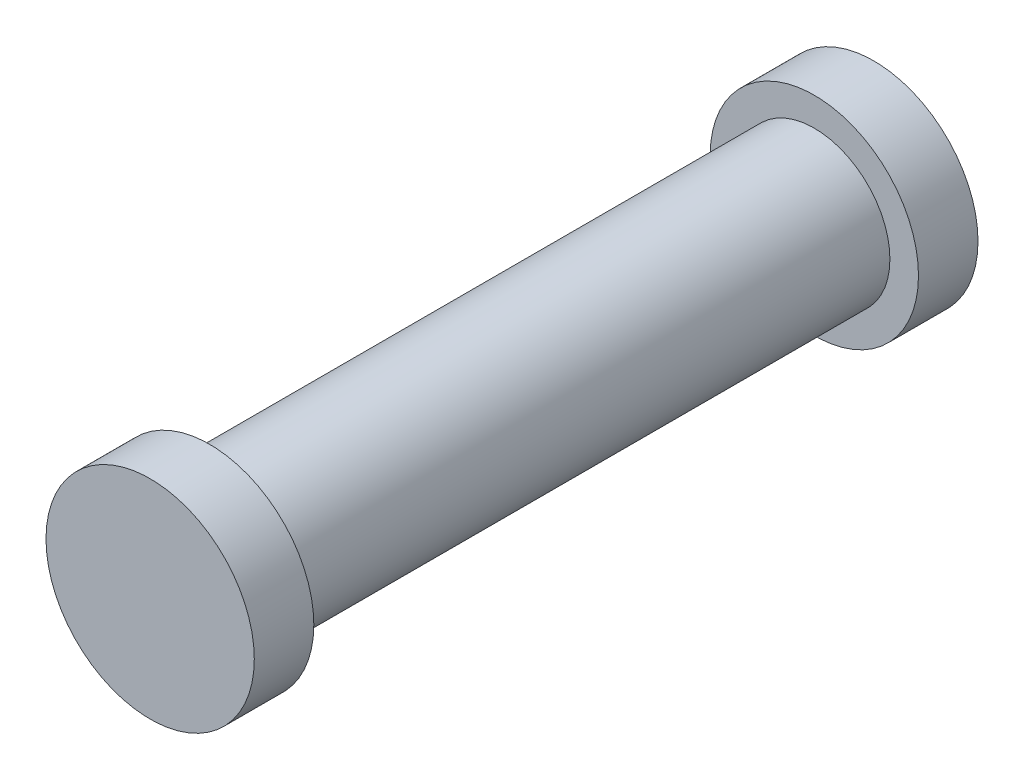
ISO-10303-21;
HEADER;
FILE_DESCRIPTION(('STEP AP214'),'2;1');
FILE_NAME('part.step','',(''),(''),'','','');
FILE_SCHEMA(('AUTOMOTIVE_DESIGN { 1 0 10303 214 1 1 1 1 }'));
ENDSEC;
DATA;
#1=APPLICATION_CONTEXT('core data for automotive mechanical design processes');
#2=APPLICATION_PROTOCOL_DEFINITION('international standard','automotive_design',2000,#1);
#3=PRODUCT_CONTEXT('',#1,'mechanical');
#4=PRODUCT('Part','Part','',(#3));
#5=PRODUCT_RELATED_PRODUCT_CATEGORY('part','',(#4));
#6=PRODUCT_DEFINITION_FORMATION('','',#4);
#7=PRODUCT_DEFINITION_CONTEXT('part definition',#1,'design');
#8=PRODUCT_DEFINITION('design','',#6,#7);
#9=PRODUCT_DEFINITION_SHAPE('','',#8);
#10=(LENGTH_UNIT() NAMED_UNIT(*) SI_UNIT(.MILLI.,.METRE.));
#11=(NAMED_UNIT(*) PLANE_ANGLE_UNIT() SI_UNIT($,.RADIAN.));
#12=(NAMED_UNIT(*) SI_UNIT($,.STERADIAN.) SOLID_ANGLE_UNIT());
#13=UNCERTAINTY_MEASURE_WITH_UNIT(LENGTH_MEASURE(1.E-05),#10,'distance_accuracy_value','');
#14=(GEOMETRIC_REPRESENTATION_CONTEXT(3) GLOBAL_UNCERTAINTY_ASSIGNED_CONTEXT((#13)) GLOBAL_UNIT_ASSIGNED_CONTEXT((#10,
#11,#12)) REPRESENTATION_CONTEXT('',''));
#15=CARTESIAN_POINT('',(0.,0.,0.));
#16=DIRECTION('',(0.,0.,1.));
#17=DIRECTION('',(1.,0.,0.));
#18=AXIS2_PLACEMENT_3D('',#15,#16,#17);
#19=CARTESIAN_POINT('',(0.,0.,50.8));
#20=DIRECTION('',(0.,0.,-1.));
#21=DIRECTION('',(-1.,0.,0.));
#22=AXIS2_PLACEMENT_3D('',#19,#20,#21);
#23=CYLINDRICAL_SURFACE('',#22,12.7);
#24=CARTESIAN_POINT('',(0.,0.,50.8));
#25=DIRECTION('',(0.,0.,1.));
#26=DIRECTION('',(1.,0.,0.));
#27=AXIS2_PLACEMENT_3D('',#24,#25,#26);
#28=CIRCLE('',#27,12.7);
#29=CARTESIAN_POINT('',(12.7,0.,50.8));
#30=VERTEX_POINT('',#29);
#31=EDGE_CURVE('E10',#30,#30,#28,.T.);
#32=ORIENTED_EDGE('',*,*,#31,.F.);
#33=EDGE_LOOP('',(#32));
#34=FACE_BOUND('',#33,.T.);
#35=CARTESIAN_POINT('',(0.,0.,-50.8));
#36=DIRECTION('',(0.,0.,1.));
#37=DIRECTION('',(1.,0.,0.));
#38=AXIS2_PLACEMENT_3D('',#35,#36,#37);
#39=CIRCLE('',#38,12.7);
#40=CARTESIAN_POINT('',(12.7,0.,-50.8));
#41=VERTEX_POINT('',#40);
#42=EDGE_CURVE('E35',#41,#41,#39,.T.);
#43=ORIENTED_EDGE('',*,*,#42,.T.);
#44=EDGE_LOOP('',(#43));
#45=FACE_BOUND('',#44,.T.);
#46=ADVANCED_FACE('F32',(#34,#45),#23,.T.);
#47=CARTESIAN_POINT('',(0.,0.,60.8));
#48=DIRECTION('',(0.,0.,-1.));
#49=DIRECTION('',(-1.,0.,0.));
#50=AXIS2_PLACEMENT_3D('',#47,#48,#49);
#51=CYLINDRICAL_SURFACE('',#50,17.5);
#52=CARTESIAN_POINT('',(0.,0.,60.8));
#53=DIRECTION('',(0.,0.,1.));
#54=DIRECTION('',(1.,0.,0.));
#55=AXIS2_PLACEMENT_3D('',#52,#53,#54);
#56=CIRCLE('',#55,17.5);
#57=CARTESIAN_POINT('',(17.5,0.,60.8));
#58=VERTEX_POINT('',#57);
#59=EDGE_CURVE('E39',#58,#58,#56,.T.);
#60=ORIENTED_EDGE('',*,*,#59,.F.);
#61=EDGE_LOOP('',(#60));
#62=FACE_BOUND('',#61,.T.);
#63=CARTESIAN_POINT('',(0.,0.,50.8));
#64=DIRECTION('',(0.,0.,1.));
#65=DIRECTION('',(1.,0.,0.));
#66=AXIS2_PLACEMENT_3D('',#63,#64,#65);
#67=CIRCLE('',#66,17.5);
#68=CARTESIAN_POINT('',(17.5,0.,50.8));
#69=VERTEX_POINT('',#68);
#70=EDGE_CURVE('E43',#69,#69,#67,.T.);
#71=ORIENTED_EDGE('',*,*,#70,.T.);
#72=EDGE_LOOP('',(#71));
#73=FACE_BOUND('',#72,.T.);
#74=ADVANCED_FACE('F80',(#62,#73),#51,.T.);
#75=CARTESIAN_POINT('',(0.,0.,60.8));
#76=DIRECTION('',(0.,0.,1.));
#77=DIRECTION('',(1.,0.,0.));
#78=AXIS2_PLACEMENT_3D('',#75,#76,#77);
#79=PLANE('',#78);
#80=ORIENTED_EDGE('',*,*,#59,.T.);
#81=EDGE_LOOP('',(#80));
#82=FACE_BOUND('',#81,.T.);
#83=ADVANCED_FACE('F76',(#82),#79,.T.);
#84=CARTESIAN_POINT('',(0.,0.,50.8));
#85=DIRECTION('',(0.,0.,1.));
#86=DIRECTION('',(1.,0.,0.));
#87=AXIS2_PLACEMENT_3D('',#84,#85,#86);
#88=PLANE('',#87);
#89=ORIENTED_EDGE('',*,*,#31,.T.);
#90=EDGE_LOOP('',(#89));
#91=FACE_BOUND('',#90,.T.);
#92=ORIENTED_EDGE('',*,*,#70,.F.);
#93=EDGE_LOOP('',(#92));
#94=FACE_BOUND('',#93,.T.);
#95=ADVANCED_FACE('F68',(#91,#94),#88,.F.);
#96=CARTESIAN_POINT('',(0.,0.,-60.8));
#97=DIRECTION('',(0.,0.,1.));
#98=DIRECTION('',(1.,0.,0.));
#99=AXIS2_PLACEMENT_3D('',#96,#97,#98);
#100=CYLINDRICAL_SURFACE('',#99,17.5);
#101=CARTESIAN_POINT('',(0.,0.,-60.8));
#102=DIRECTION('',(0.,0.,1.));
#103=DIRECTION('',(1.,0.,0.));
#104=AXIS2_PLACEMENT_3D('',#101,#102,#103);
#105=CIRCLE('',#104,17.5);
#106=CARTESIAN_POINT('',(17.5,0.,-60.8));
#107=VERTEX_POINT('',#106);
#108=EDGE_CURVE('E51',#107,#107,#105,.T.);
#109=ORIENTED_EDGE('',*,*,#108,.T.);
#110=EDGE_LOOP('',(#109));
#111=FACE_BOUND('',#110,.T.);
#112=CARTESIAN_POINT('',(0.,0.,-50.8));
#113=DIRECTION('',(0.,0.,1.));
#114=DIRECTION('',(1.,0.,0.));
#115=AXIS2_PLACEMENT_3D('',#112,#113,#114);
#116=CIRCLE('',#115,17.5);
#117=CARTESIAN_POINT('',(17.5,0.,-50.8));
#118=VERTEX_POINT('',#117);
#119=EDGE_CURVE('E48',#118,#118,#116,.T.);
#120=ORIENTED_EDGE('',*,*,#119,.F.);
#121=EDGE_LOOP('',(#120));
#122=FACE_BOUND('',#121,.T.);
#123=ADVANCED_FACE('F66',(#111,#122),#100,.T.);
#124=CARTESIAN_POINT('',(0.,0.,-60.8));
#125=DIRECTION('',(0.,0.,-1.));
#126=DIRECTION('',(1.,0.,0.));
#127=AXIS2_PLACEMENT_3D('',#124,#125,#126);
#128=PLANE('',#127);
#129=ORIENTED_EDGE('',*,*,#108,.F.);
#130=EDGE_LOOP('',(#129));
#131=FACE_BOUND('',#130,.T.);
#132=ADVANCED_FACE('F62',(#131),#128,.T.);
#133=CARTESIAN_POINT('',(0.,0.,-50.8));
#134=DIRECTION('',(0.,0.,-1.));
#135=DIRECTION('',(1.,0.,0.));
#136=AXIS2_PLACEMENT_3D('',#133,#134,#135);
#137=PLANE('',#136);
#138=ORIENTED_EDGE('',*,*,#42,.F.);
#139=EDGE_LOOP('',(#138));
#140=FACE_BOUND('',#139,.T.);
#141=ORIENTED_EDGE('',*,*,#119,.T.);
#142=EDGE_LOOP('',(#141));
#143=FACE_BOUND('',#142,.T.);
#144=ADVANCED_FACE('F59',(#140,#143),#137,.F.);
#145=CLOSED_SHELL('',(#46,#74,#83,#95,#123,#132,#144));
#146=MANIFOLD_SOLID_BREP('B2',#145);
#147=ADVANCED_BREP_SHAPE_REPRESENTATION('',(#18,#146),#14);
#148=SHAPE_DEFINITION_REPRESENTATION(#9,#147);
ENDSEC;
END-ISO-10303-21;
